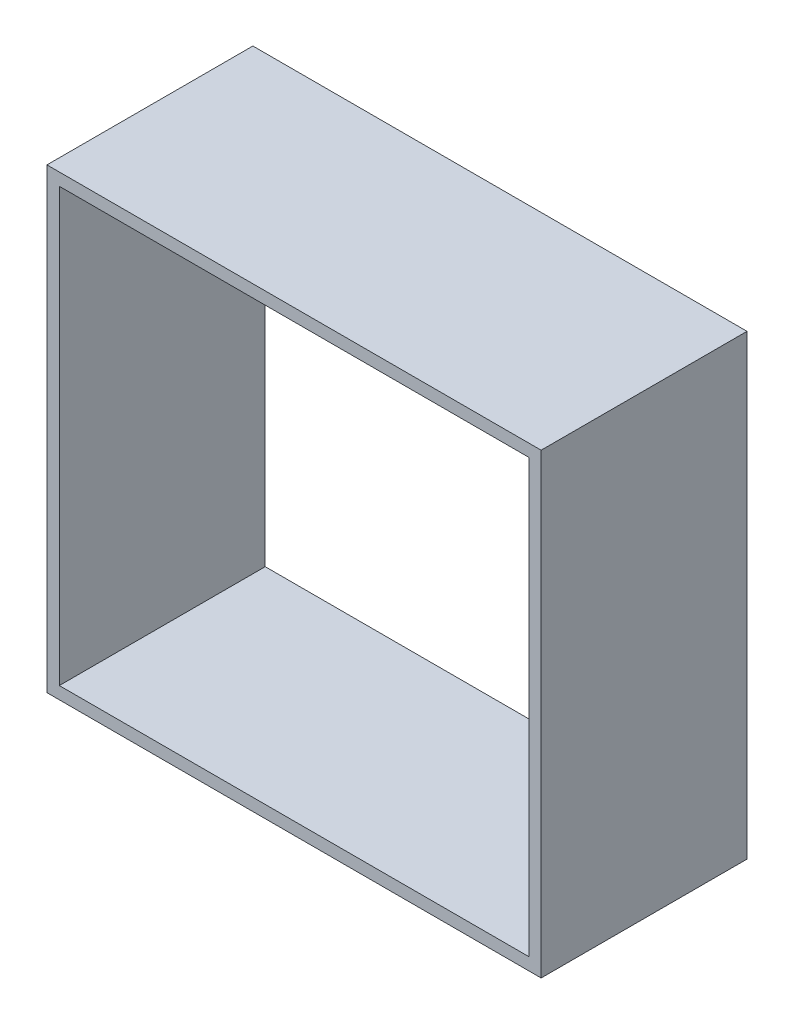
ISO-10303-21;
HEADER;
FILE_DESCRIPTION(('STEP AP214'),'2;1');
FILE_NAME('part.step','',(''),(''),'','','');
FILE_SCHEMA(('AUTOMOTIVE_DESIGN { 1 0 10303 214 1 1 1 1 }'));
ENDSEC;
DATA;
#1=APPLICATION_CONTEXT('core data for automotive mechanical design processes');
#2=APPLICATION_PROTOCOL_DEFINITION('international standard','automotive_design',2000,#1);
#3=PRODUCT_CONTEXT('',#1,'mechanical');
#4=PRODUCT('Part','Part','',(#3));
#5=PRODUCT_RELATED_PRODUCT_CATEGORY('part','',(#4));
#6=PRODUCT_DEFINITION_FORMATION('','',#4);
#7=PRODUCT_DEFINITION_CONTEXT('part definition',#1,'design');
#8=PRODUCT_DEFINITION('design','',#6,#7);
#9=PRODUCT_DEFINITION_SHAPE('','',#8);
#10=(LENGTH_UNIT() NAMED_UNIT(*) SI_UNIT(.MILLI.,.METRE.));
#11=(NAMED_UNIT(*) PLANE_ANGLE_UNIT() SI_UNIT($,.RADIAN.));
#12=(NAMED_UNIT(*) SI_UNIT($,.STERADIAN.) SOLID_ANGLE_UNIT());
#13=UNCERTAINTY_MEASURE_WITH_UNIT(LENGTH_MEASURE(1.E-05),#10,'distance_accuracy_value','');
#14=(GEOMETRIC_REPRESENTATION_CONTEXT(3) GLOBAL_UNCERTAINTY_ASSIGNED_CONTEXT((#13)) GLOBAL_UNIT_ASSIGNED_CONTEXT((#10,
#11,#12)) REPRESENTATION_CONTEXT('',''));
#15=CARTESIAN_POINT('',(0.,0.,0.));
#16=DIRECTION('',(0.,0.,1.));
#17=DIRECTION('',(1.,0.,0.));
#18=AXIS2_PLACEMENT_3D('',#15,#16,#17);
#19=CARTESIAN_POINT('',(0.,0.,25.));
#20=DIRECTION('',(0.,0.,-1.));
#21=DIRECTION('',(-1.,0.,0.));
#22=AXIS2_PLACEMENT_3D('',#19,#20,#21);
#23=PLANE('',#22);
#24=DIRECTION('',(-1.,0.,0.));
#25=VECTOR('',#24,1.);
#26=CARTESIAN_POINT('',(-90.9895833333334,55.5,25.));
#27=LINE('',#26,#25);
#28=CARTESIAN_POINT('',(-30.9895833333334,55.5,25.));
#29=VERTEX_POINT('',#28);
#30=CARTESIAN_POINT('',(-90.9895833333334,55.5,25.));
#31=VERTEX_POINT('',#30);
#32=EDGE_CURVE('E138',#29,#31,#27,.T.);
#33=ORIENTED_EDGE('',*,*,#32,.T.);
#34=DIRECTION('',(0.,-1.,0.));
#35=VECTOR('',#34,1.);
#36=CARTESIAN_POINT('',(-90.9895833333334,55.5,25.));
#37=LINE('',#36,#35);
#38=CARTESIAN_POINT('',(-90.9895833333334,0.,25.));
#39=VERTEX_POINT('',#38);
#40=EDGE_CURVE('E141',#31,#39,#37,.T.);
#41=ORIENTED_EDGE('',*,*,#40,.T.);
#42=DIRECTION('',(1.,0.,0.));
#43=VECTOR('',#42,1.);
#44=CARTESIAN_POINT('',(-90.9895833333334,0.,25.));
#45=LINE('',#44,#43);
#46=CARTESIAN_POINT('',(-30.9895833333334,0.,25.));
#47=VERTEX_POINT('',#46);
#48=EDGE_CURVE('E144',#39,#47,#45,.T.);
#49=ORIENTED_EDGE('',*,*,#48,.T.);
#50=DIRECTION('',(0.,1.,0.));
#51=VECTOR('',#50,1.);
#52=CARTESIAN_POINT('',(-30.9895833333334,55.5,25.));
#53=LINE('',#52,#51);
#54=EDGE_CURVE('E146',#47,#29,#53,.T.);
#55=ORIENTED_EDGE('',*,*,#54,.T.);
#56=EDGE_LOOP('',(#33,#41,#49,#55));
#57=FACE_BOUND('',#56,.T.);
#58=DIRECTION('',(-1.,0.,0.));
#59=VECTOR('',#58,1.);
#60=CARTESIAN_POINT('',(-89.4895833333334,54.,25.));
#61=LINE('',#60,#59);
#62=CARTESIAN_POINT('',(-32.4895833333334,54.,25.));
#63=VERTEX_POINT('',#62);
#64=CARTESIAN_POINT('',(-89.4895833333334,54.,25.));
#65=VERTEX_POINT('',#64);
#66=EDGE_CURVE('E102',#63,#65,#61,.T.);
#67=ORIENTED_EDGE('',*,*,#66,.F.);
#68=DIRECTION('',(0.,1.,0.));
#69=VECTOR('',#68,1.);
#70=CARTESIAN_POINT('',(-32.4895833333334,54.,25.));
#71=LINE('',#70,#69);
#72=CARTESIAN_POINT('',(-32.4895833333334,1.5,25.));
#73=VERTEX_POINT('',#72);
#74=EDGE_CURVE('E124',#73,#63,#71,.T.);
#75=ORIENTED_EDGE('',*,*,#74,.F.);
#76=DIRECTION('',(1.,0.,0.));
#77=VECTOR('',#76,1.);
#78=CARTESIAN_POINT('',(-89.4895833333334,1.5,25.));
#79=LINE('',#78,#77);
#80=CARTESIAN_POINT('',(-89.4895833333334,1.5,25.));
#81=VERTEX_POINT('',#80);
#82=EDGE_CURVE('E122',#81,#73,#79,.T.);
#83=ORIENTED_EDGE('',*,*,#82,.F.);
#84=DIRECTION('',(0.,-1.,0.));
#85=VECTOR('',#84,1.);
#86=CARTESIAN_POINT('',(-89.4895833333334,54.,25.));
#87=LINE('',#86,#85);
#88=EDGE_CURVE('E110',#65,#81,#87,.T.);
#89=ORIENTED_EDGE('',*,*,#88,.F.);
#90=EDGE_LOOP('',(#67,#75,#83,#89));
#91=FACE_BOUND('',#90,.T.);
#92=ADVANCED_FACE('F37',(#57,#91),#23,.F.);
#93=CARTESIAN_POINT('',(0.,0.,0.));
#94=DIRECTION('',(0.,0.,-1.));
#95=DIRECTION('',(-1.,0.,0.));
#96=AXIS2_PLACEMENT_3D('',#93,#94,#95);
#97=PLANE('',#96);
#98=DIRECTION('',(-1.,0.,0.));
#99=VECTOR('',#98,1.);
#100=CARTESIAN_POINT('',(-90.9895833333334,55.5,0.));
#101=LINE('',#100,#99);
#102=CARTESIAN_POINT('',(-30.9895833333334,55.5,0.));
#103=VERTEX_POINT('',#102);
#104=CARTESIAN_POINT('',(-90.9895833333334,55.5,0.));
#105=VERTEX_POINT('',#104);
#106=EDGE_CURVE('E118',#103,#105,#101,.T.);
#107=ORIENTED_EDGE('',*,*,#106,.F.);
#108=DIRECTION('',(0.,1.,0.));
#109=VECTOR('',#108,1.);
#110=CARTESIAN_POINT('',(-30.9895833333334,55.5,0.));
#111=LINE('',#110,#109);
#112=CARTESIAN_POINT('',(-30.9895833333334,0.,0.));
#113=VERTEX_POINT('',#112);
#114=EDGE_CURVE('E142',#113,#103,#111,.T.);
#115=ORIENTED_EDGE('',*,*,#114,.F.);
#116=DIRECTION('',(1.,0.,0.));
#117=VECTOR('',#116,1.);
#118=CARTESIAN_POINT('',(-90.9895833333334,0.,0.));
#119=LINE('',#118,#117);
#120=CARTESIAN_POINT('',(-90.9895833333334,0.,0.));
#121=VERTEX_POINT('',#120);
#122=EDGE_CURVE('E153',#121,#113,#119,.T.);
#123=ORIENTED_EDGE('',*,*,#122,.F.);
#124=DIRECTION('',(0.,-1.,0.));
#125=VECTOR('',#124,1.);
#126=CARTESIAN_POINT('',(-90.9895833333334,55.5,0.));
#127=LINE('',#126,#125);
#128=EDGE_CURVE('E151',#105,#121,#127,.T.);
#129=ORIENTED_EDGE('',*,*,#128,.F.);
#130=EDGE_LOOP('',(#107,#115,#123,#129));
#131=FACE_BOUND('',#130,.T.);
#132=DIRECTION('',(0.,1.,0.));
#133=VECTOR('',#132,1.);
#134=CARTESIAN_POINT('',(-32.4895833333334,54.,0.));
#135=LINE('',#134,#133);
#136=CARTESIAN_POINT('',(-32.4895833333334,1.5,0.));
#137=VERTEX_POINT('',#136);
#138=CARTESIAN_POINT('',(-32.4895833333334,54.,0.));
#139=VERTEX_POINT('',#138);
#140=EDGE_CURVE('E111',#137,#139,#135,.T.);
#141=ORIENTED_EDGE('',*,*,#140,.T.);
#142=DIRECTION('',(-1.,0.,0.));
#143=VECTOR('',#142,1.);
#144=CARTESIAN_POINT('',(-89.4895833333334,54.,0.));
#145=LINE('',#144,#143);
#146=CARTESIAN_POINT('',(-89.4895833333334,54.,0.));
#147=VERTEX_POINT('',#146);
#148=EDGE_CURVE('E60',#139,#147,#145,.T.);
#149=ORIENTED_EDGE('',*,*,#148,.T.);
#150=DIRECTION('',(0.,-1.,0.));
#151=VECTOR('',#150,1.);
#152=CARTESIAN_POINT('',(-89.4895833333334,54.,0.));
#153=LINE('',#152,#151);
#154=CARTESIAN_POINT('',(-89.4895833333334,1.5,0.));
#155=VERTEX_POINT('',#154);
#156=EDGE_CURVE('E117',#147,#155,#153,.T.);
#157=ORIENTED_EDGE('',*,*,#156,.T.);
#158=DIRECTION('',(1.,0.,0.));
#159=VECTOR('',#158,1.);
#160=CARTESIAN_POINT('',(-89.4895833333334,1.5,0.));
#161=LINE('',#160,#159);
#162=EDGE_CURVE('E130',#155,#137,#161,.T.);
#163=ORIENTED_EDGE('',*,*,#162,.T.);
#164=EDGE_LOOP('',(#141,#149,#157,#163));
#165=FACE_BOUND('',#164,.T.);
#166=ADVANCED_FACE('F171',(#131,#165),#97,.T.);
#167=CARTESIAN_POINT('',(-90.9895833333334,55.5,25.));
#168=DIRECTION('',(0.,-1.,0.));
#169=DIRECTION('',(0.,0.,-1.));
#170=AXIS2_PLACEMENT_3D('',#167,#168,#169);
#171=PLANE('',#170);
#172=ORIENTED_EDGE('',*,*,#106,.T.);
#173=DIRECTION('',(0.,0.,-1.));
#174=VECTOR('',#173,1.);
#175=CARTESIAN_POINT('',(-90.9895833333334,55.5,25.));
#176=LINE('',#175,#174);
#177=EDGE_CURVE('E11',#31,#105,#176,.T.);
#178=ORIENTED_EDGE('',*,*,#177,.F.);
#179=ORIENTED_EDGE('',*,*,#32,.F.);
#180=DIRECTION('',(0.,0.,-1.));
#181=VECTOR('',#180,1.);
#182=CARTESIAN_POINT('',(-30.9895833333334,55.5,25.));
#183=LINE('',#182,#181);
#184=EDGE_CURVE('E148',#29,#103,#183,.T.);
#185=ORIENTED_EDGE('',*,*,#184,.T.);
#186=EDGE_LOOP('',(#172,#178,#179,#185));
#187=FACE_BOUND('',#186,.T.);
#188=ADVANCED_FACE('F39',(#187),#171,.F.);
#189=CARTESIAN_POINT('',(-90.9895833333334,55.5,25.));
#190=DIRECTION('',(1.,0.,0.));
#191=DIRECTION('',(0.,0.,-1.));
#192=AXIS2_PLACEMENT_3D('',#189,#190,#191);
#193=PLANE('',#192);
#194=ORIENTED_EDGE('',*,*,#128,.T.);
#195=DIRECTION('',(0.,0.,-1.));
#196=VECTOR('',#195,1.);
#197=CARTESIAN_POINT('',(-90.9895833333334,0.,25.));
#198=LINE('',#197,#196);
#199=EDGE_CURVE('E45',#39,#121,#198,.T.);
#200=ORIENTED_EDGE('',*,*,#199,.F.);
#201=ORIENTED_EDGE('',*,*,#40,.F.);
#202=ORIENTED_EDGE('',*,*,#177,.T.);
#203=EDGE_LOOP('',(#194,#200,#201,#202));
#204=FACE_BOUND('',#203,.T.);
#205=ADVANCED_FACE('F181',(#204),#193,.F.);
#206=CARTESIAN_POINT('',(-90.9895833333334,0.,25.));
#207=DIRECTION('',(0.,1.,0.));
#208=DIRECTION('',(0.,0.,1.));
#209=AXIS2_PLACEMENT_3D('',#206,#207,#208);
#210=PLANE('',#209);
#211=ORIENTED_EDGE('',*,*,#122,.T.);
#212=DIRECTION('',(0.,0.,-1.));
#213=VECTOR('',#212,1.);
#214=CARTESIAN_POINT('',(-30.9895833333334,0.,25.));
#215=LINE('',#214,#213);
#216=EDGE_CURVE('E158',#47,#113,#215,.T.);
#217=ORIENTED_EDGE('',*,*,#216,.F.);
#218=ORIENTED_EDGE('',*,*,#48,.F.);
#219=ORIENTED_EDGE('',*,*,#199,.T.);
#220=EDGE_LOOP('',(#211,#217,#218,#219));
#221=FACE_BOUND('',#220,.T.);
#222=ADVANCED_FACE('F165',(#221),#210,.F.);
#223=CARTESIAN_POINT('',(-30.9895833333334,55.5,25.));
#224=DIRECTION('',(-1.,0.,0.));
#225=DIRECTION('',(0.,0.,1.));
#226=AXIS2_PLACEMENT_3D('',#223,#224,#225);
#227=PLANE('',#226);
#228=ORIENTED_EDGE('',*,*,#114,.T.);
#229=ORIENTED_EDGE('',*,*,#184,.F.);
#230=ORIENTED_EDGE('',*,*,#54,.F.);
#231=ORIENTED_EDGE('',*,*,#216,.T.);
#232=EDGE_LOOP('',(#228,#229,#230,#231));
#233=FACE_BOUND('',#232,.T.);
#234=ADVANCED_FACE('F175',(#233),#227,.F.);
#235=CARTESIAN_POINT('',(-89.4895833333334,54.,25.));
#236=DIRECTION('',(0.,-1.,0.));
#237=DIRECTION('',(0.,0.,-1.));
#238=AXIS2_PLACEMENT_3D('',#235,#236,#237);
#239=PLANE('',#238);
#240=ORIENTED_EDGE('',*,*,#148,.F.);
#241=DIRECTION('',(0.,0.,-1.));
#242=VECTOR('',#241,1.);
#243=CARTESIAN_POINT('',(-32.4895833333334,54.,25.));
#244=LINE('',#243,#242);
#245=EDGE_CURVE('E106',#63,#139,#244,.T.);
#246=ORIENTED_EDGE('',*,*,#245,.F.);
#247=ORIENTED_EDGE('',*,*,#66,.T.);
#248=DIRECTION('',(0.,0.,-1.));
#249=VECTOR('',#248,1.);
#250=CARTESIAN_POINT('',(-89.4895833333334,54.,25.));
#251=LINE('',#250,#249);
#252=EDGE_CURVE('E105',#65,#147,#251,.T.);
#253=ORIENTED_EDGE('',*,*,#252,.T.);
#254=EDGE_LOOP('',(#240,#246,#247,#253));
#255=FACE_BOUND('',#254,.T.);
#256=ADVANCED_FACE('F104',(#255),#239,.T.);
#257=CARTESIAN_POINT('',(-89.4895833333334,54.,25.));
#258=DIRECTION('',(1.,0.,0.));
#259=DIRECTION('',(0.,0.,-1.));
#260=AXIS2_PLACEMENT_3D('',#257,#258,#259);
#261=PLANE('',#260);
#262=ORIENTED_EDGE('',*,*,#156,.F.);
#263=ORIENTED_EDGE('',*,*,#252,.F.);
#264=ORIENTED_EDGE('',*,*,#88,.T.);
#265=DIRECTION('',(0.,0.,-1.));
#266=VECTOR('',#265,1.);
#267=CARTESIAN_POINT('',(-89.4895833333334,1.5,25.));
#268=LINE('',#267,#266);
#269=EDGE_CURVE('E119',#81,#155,#268,.T.);
#270=ORIENTED_EDGE('',*,*,#269,.T.);
#271=EDGE_LOOP('',(#262,#263,#264,#270));
#272=FACE_BOUND('',#271,.T.);
#273=ADVANCED_FACE('F114',(#272),#261,.T.);
#274=CARTESIAN_POINT('',(-89.4895833333334,1.5,25.));
#275=DIRECTION('',(0.,1.,0.));
#276=DIRECTION('',(-1.,0.,0.));
#277=AXIS2_PLACEMENT_3D('',#274,#275,#276);
#278=PLANE('',#277);
#279=ORIENTED_EDGE('',*,*,#162,.F.);
#280=ORIENTED_EDGE('',*,*,#269,.F.);
#281=ORIENTED_EDGE('',*,*,#82,.T.);
#282=DIRECTION('',(0.,0.,-1.));
#283=VECTOR('',#282,1.);
#284=CARTESIAN_POINT('',(-32.4895833333334,1.5,25.));
#285=LINE('',#284,#283);
#286=EDGE_CURVE('E52',#73,#137,#285,.T.);
#287=ORIENTED_EDGE('',*,*,#286,.T.);
#288=EDGE_LOOP('',(#279,#280,#281,#287));
#289=FACE_BOUND('',#288,.T.);
#290=ADVANCED_FACE('F204',(#289),#278,.T.);
#291=CARTESIAN_POINT('',(-32.4895833333334,54.,25.));
#292=DIRECTION('',(-1.,0.,0.));
#293=DIRECTION('',(0.,-1.,0.));
#294=AXIS2_PLACEMENT_3D('',#291,#292,#293);
#295=PLANE('',#294);
#296=ORIENTED_EDGE('',*,*,#140,.F.);
#297=ORIENTED_EDGE('',*,*,#286,.F.);
#298=ORIENTED_EDGE('',*,*,#74,.T.);
#299=ORIENTED_EDGE('',*,*,#245,.T.);
#300=EDGE_LOOP('',(#296,#297,#298,#299));
#301=FACE_BOUND('',#300,.T.);
#302=ADVANCED_FACE('F208',(#301),#295,.T.);
#303=CLOSED_SHELL('',(#92,#166,#188,#205,#222,#234,#256,#273,#290,#302));
#304=MANIFOLD_SOLID_BREP('B2',#303);
#305=ADVANCED_BREP_SHAPE_REPRESENTATION('',(#18,#304),#14);
#306=SHAPE_DEFINITION_REPRESENTATION(#9,#305);
ENDSEC;
END-ISO-10303-21;
